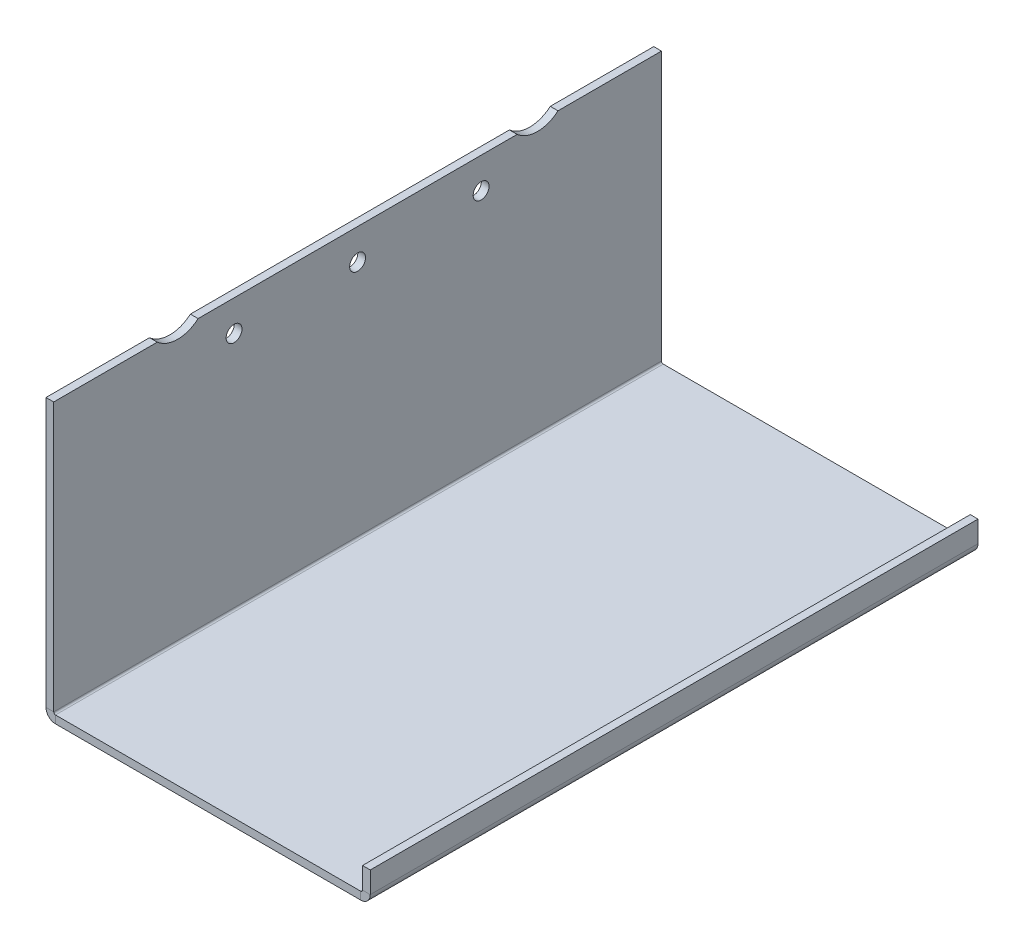
ISO-10303-21;
HEADER;
FILE_DESCRIPTION(('STEP AP214'),'2;1');
FILE_NAME('part.step','',(''),(''),'','','');
FILE_SCHEMA(('AUTOMOTIVE_DESIGN { 1 0 10303 214 1 1 1 1 }'));
ENDSEC;
DATA;
#1=APPLICATION_CONTEXT('core data for automotive mechanical design processes');
#2=APPLICATION_PROTOCOL_DEFINITION('international standard','automotive_design',2000,#1);
#3=PRODUCT_CONTEXT('',#1,'mechanical');
#4=PRODUCT('Part','Part','',(#3));
#5=PRODUCT_RELATED_PRODUCT_CATEGORY('part','',(#4));
#6=PRODUCT_DEFINITION_FORMATION('','',#4);
#7=PRODUCT_DEFINITION_CONTEXT('part definition',#1,'design');
#8=PRODUCT_DEFINITION('design','',#6,#7);
#9=PRODUCT_DEFINITION_SHAPE('','',#8);
#10=(LENGTH_UNIT() NAMED_UNIT(*) SI_UNIT(.MILLI.,.METRE.));
#11=(NAMED_UNIT(*) PLANE_ANGLE_UNIT() SI_UNIT($,.RADIAN.));
#12=(NAMED_UNIT(*) SI_UNIT($,.STERADIAN.) SOLID_ANGLE_UNIT());
#13=UNCERTAINTY_MEASURE_WITH_UNIT(LENGTH_MEASURE(1.E-05),#10,'distance_accuracy_value','');
#14=(GEOMETRIC_REPRESENTATION_CONTEXT(3) GLOBAL_UNCERTAINTY_ASSIGNED_CONTEXT((#13)) GLOBAL_UNIT_ASSIGNED_CONTEXT((#10,
#11,#12)) REPRESENTATION_CONTEXT('',''));
#15=CARTESIAN_POINT('',(0.,0.,0.));
#16=DIRECTION('',(0.,0.,1.));
#17=DIRECTION('',(1.,0.,0.));
#18=AXIS2_PLACEMENT_3D('',#15,#16,#17);
#19=CARTESIAN_POINT('',(-66.6750000000004,112.7125,-124.968));
#20=DIRECTION('',(0.,-1.,0.));
#21=DIRECTION('',(1.,0.,0.));
#22=AXIS2_PLACEMENT_3D('',#19,#20,#21);
#23=PLANE('',#22);
#24=DIRECTION('',(0.,0.,-1.));
#25=VECTOR('',#24,1.);
#26=CARTESIAN_POINT('',(-66.6750000000004,112.7125,0.));
#27=LINE('',#26,#25);
#28=CARTESIAN_POINT('',(-66.6750000000011,112.7125,65.5997395873699));
#29=VERTEX_POINT('',#28);
#30=CARTESIAN_POINT('',(-66.6750000000004,112.7125,-65.5997395873699));
#31=VERTEX_POINT('',#30);
#32=EDGE_CURVE('E290',#29,#31,#27,.T.);
#33=ORIENTED_EDGE('',*,*,#32,.F.);
#34=DIRECTION('',(1.,0.,0.));
#35=VECTOR('',#34,1.);
#36=CARTESIAN_POINT('',(-66.6750000000011,112.7125,65.5997395873699));
#37=LINE('',#36,#35);
#38=CARTESIAN_POINT('',(-63.5000000000004,112.7125,65.5997395873699));
#39=VERTEX_POINT('',#38);
#40=EDGE_CURVE('E15',#29,#39,#37,.T.);
#41=ORIENTED_EDGE('',*,*,#40,.T.);
#42=DIRECTION('',(0.,0.,1.));
#43=VECTOR('',#42,1.);
#44=CARTESIAN_POINT('',(-63.5000000000004,112.7125,-124.968));
#45=LINE('',#44,#43);
#46=CARTESIAN_POINT('',(-63.5000000000004,112.7125,-65.5997395873699));
#47=VERTEX_POINT('',#46);
#48=EDGE_CURVE('E218',#39,#47,#45,.F.);
#49=ORIENTED_EDGE('',*,*,#48,.T.);
#50=DIRECTION('',(1.,0.,0.));
#51=VECTOR('',#50,1.);
#52=CARTESIAN_POINT('',(-66.6750000000011,112.7125,-65.5997395873699));
#53=LINE('',#52,#51);
#54=EDGE_CURVE('E200',#47,#31,#53,.F.);
#55=ORIENTED_EDGE('',*,*,#54,.T.);
#56=EDGE_LOOP('',(#33,#41,#49,#55));
#57=FACE_BOUND('',#56,.T.);
#58=ADVANCED_FACE('F90',(#57),#23,.F.);
#59=CARTESIAN_POINT('',(-66.6750000000011,112.7125,-82.4002604126301));
#60=VERTEX_POINT('',#59);
#61=CARTESIAN_POINT('',(-66.6750000000004,112.7125,-124.968));
#62=VERTEX_POINT('',#61);
#63=EDGE_CURVE('E292',#60,#62,#27,.T.);
#64=ORIENTED_EDGE('',*,*,#63,.F.);
#65=DIRECTION('',(1.,0.,0.));
#66=VECTOR('',#65,1.);
#67=CARTESIAN_POINT('',(-66.6750000000011,112.7125,-82.4002604126301));
#68=LINE('',#67,#66);
#69=CARTESIAN_POINT('',(-63.5000000000004,112.7125,-82.4002604126301));
#70=VERTEX_POINT('',#69);
#71=EDGE_CURVE('E209',#60,#70,#68,.T.);
#72=ORIENTED_EDGE('',*,*,#71,.T.);
#73=CARTESIAN_POINT('',(-63.5000000000004,112.7125,-124.968));
#74=VERTEX_POINT('',#73);
#75=EDGE_CURVE('E220',#70,#74,#45,.F.);
#76=ORIENTED_EDGE('',*,*,#75,.T.);
#77=DIRECTION('',(1.,0.,0.));
#78=VECTOR('',#77,1.);
#79=CARTESIAN_POINT('',(-66.6750000000004,112.7125,-124.968));
#80=LINE('',#79,#78);
#81=EDGE_CURVE('E294',#62,#74,#80,.T.);
#82=ORIENTED_EDGE('',*,*,#81,.F.);
#83=EDGE_LOOP('',(#64,#72,#76,#82));
#84=FACE_BOUND('',#83,.T.);
#85=ADVANCED_FACE('F400',(#84),#23,.F.);
#86=CARTESIAN_POINT('',(-66.675,1.5875,-124.968));
#87=DIRECTION('',(0.,0.,1.));
#88=DIRECTION('',(1.,0.,0.));
#89=AXIS2_PLACEMENT_3D('',#86,#87,#88);
#90=PLANE('',#89);
#91=DIRECTION('',(0.,-1.,0.));
#92=VECTOR('',#91,1.);
#93=CARTESIAN_POINT('',(62.7634,1.58750000000001,-124.968));
#94=LINE('',#93,#92);
#95=CARTESIAN_POINT('',(62.7634,1.58750000000001,-124.968));
#96=VERTEX_POINT('',#95);
#97=CARTESIAN_POINT('',(62.7634,-1.58749999999999,-124.968));
#98=VERTEX_POINT('',#97);
#99=EDGE_CURVE('E318',#96,#98,#94,.T.);
#100=ORIENTED_EDGE('',*,*,#99,.T.);
#101=DIRECTION('',(-1.,0.,0.));
#102=VECTOR('',#101,1.);
#103=CARTESIAN_POINT('',(-66.675,-1.5875,-124.968));
#104=LINE('',#103,#102);
#105=CARTESIAN_POINT('',(-62.7634,-1.5875,-124.968));
#106=VERTEX_POINT('',#105);
#107=EDGE_CURVE('E265',#98,#106,#104,.T.);
#108=ORIENTED_EDGE('',*,*,#107,.T.);
#109=DIRECTION('',(0.,-1.,0.));
#110=VECTOR('',#109,1.);
#111=CARTESIAN_POINT('',(-62.7634,1.5875,-124.968));
#112=LINE('',#111,#110);
#113=CARTESIAN_POINT('',(-62.7634,1.5875,-124.968));
#114=VERTEX_POINT('',#113);
#115=EDGE_CURVE('E262',#114,#106,#112,.T.);
#116=ORIENTED_EDGE('',*,*,#115,.F.);
#117=DIRECTION('',(-1.,0.,0.));
#118=VECTOR('',#117,1.);
#119=CARTESIAN_POINT('',(-66.675,1.5875,-124.968));
#120=LINE('',#119,#118);
#121=EDGE_CURVE('E268',#96,#114,#120,.T.);
#122=ORIENTED_EDGE('',*,*,#121,.F.);
#123=EDGE_LOOP('',(#100,#108,#116,#122));
#124=FACE_BOUND('',#123,.T.);
#125=ADVANCED_FACE('F92',(#124),#90,.F.);
#126=CARTESIAN_POINT('',(-66.675,1.5875,124.968));
#127=DIRECTION('',(0.,0.,-1.));
#128=DIRECTION('',(-1.,0.,0.));
#129=AXIS2_PLACEMENT_3D('',#126,#127,#128);
#130=PLANE('',#129);
#131=DIRECTION('',(0.,-1.,0.));
#132=VECTOR('',#131,1.);
#133=CARTESIAN_POINT('',(62.7634,1.58750000000001,124.968));
#134=LINE('',#133,#132);
#135=CARTESIAN_POINT('',(62.7634,1.58750000000001,124.968));
#136=VERTEX_POINT('',#135);
#137=CARTESIAN_POINT('',(62.7634,-1.5875,124.968));
#138=VERTEX_POINT('',#137);
#139=EDGE_CURVE('E241',#136,#138,#134,.T.);
#140=ORIENTED_EDGE('',*,*,#139,.F.);
#141=DIRECTION('',(1.,0.,0.));
#142=VECTOR('',#141,1.);
#143=CARTESIAN_POINT('',(-66.675,1.5875,124.968));
#144=LINE('',#143,#142);
#145=CARTESIAN_POINT('',(-62.7634,1.5875,124.968));
#146=VERTEX_POINT('',#145);
#147=EDGE_CURVE('E210',#146,#136,#144,.T.);
#148=ORIENTED_EDGE('',*,*,#147,.F.);
#149=DIRECTION('',(0.,-1.,0.));
#150=VECTOR('',#149,1.);
#151=CARTESIAN_POINT('',(-62.7634,1.5875,124.968));
#152=LINE('',#151,#150);
#153=CARTESIAN_POINT('',(-62.7634,-1.5875,124.968));
#154=VERTEX_POINT('',#153);
#155=EDGE_CURVE('E249',#146,#154,#152,.T.);
#156=ORIENTED_EDGE('',*,*,#155,.T.);
#157=DIRECTION('',(1.,0.,0.));
#158=VECTOR('',#157,1.);
#159=CARTESIAN_POINT('',(-66.675,-1.5875,124.968));
#160=LINE('',#159,#158);
#161=EDGE_CURVE('E270',#154,#138,#160,.T.);
#162=ORIENTED_EDGE('',*,*,#161,.T.);
#163=EDGE_LOOP('',(#140,#148,#156,#162));
#164=FACE_BOUND('',#163,.T.);
#165=ADVANCED_FACE('F450',(#164),#130,.F.);
#166=CARTESIAN_POINT('',(0.,1.5875,0.));
#167=DIRECTION('',(0.,-1.,0.));
#168=DIRECTION('',(0.,0.,-1.));
#169=AXIS2_PLACEMENT_3D('',#166,#167,#168);
#170=PLANE('',#169);
#171=DIRECTION('',(0.,0.,-1.));
#172=VECTOR('',#171,1.);
#173=CARTESIAN_POINT('',(62.7634,1.58750000000001,-124.968));
#174=LINE('',#173,#172);
#175=EDGE_CURVE('E327',#96,#136,#174,.F.);
#176=ORIENTED_EDGE('',*,*,#175,.F.);
#177=ORIENTED_EDGE('',*,*,#121,.T.);
#178=DIRECTION('',(0.,0.,1.));
#179=VECTOR('',#178,1.);
#180=CARTESIAN_POINT('',(-62.7634,1.5875,124.968));
#181=LINE('',#180,#179);
#182=EDGE_CURVE('E255',#146,#114,#181,.F.);
#183=ORIENTED_EDGE('',*,*,#182,.F.);
#184=ORIENTED_EDGE('',*,*,#147,.T.);
#185=EDGE_LOOP('',(#176,#177,#183,#184));
#186=FACE_BOUND('',#185,.T.);
#187=ADVANCED_FACE('F447',(#186),#170,.F.);
#188=CARTESIAN_POINT('',(0.,-1.5875,0.));
#189=DIRECTION('',(0.,-1.,0.));
#190=DIRECTION('',(0.,0.,-1.));
#191=AXIS2_PLACEMENT_3D('',#188,#189,#190);
#192=PLANE('',#191);
#193=ORIENTED_EDGE('',*,*,#107,.F.);
#194=DIRECTION('',(0.,0.,-1.));
#195=VECTOR('',#194,1.);
#196=CARTESIAN_POINT('',(62.7634,-1.58749999999999,-124.968));
#197=LINE('',#196,#195);
#198=EDGE_CURVE('E336',#98,#138,#197,.F.);
#199=ORIENTED_EDGE('',*,*,#198,.T.);
#200=ORIENTED_EDGE('',*,*,#161,.F.);
#201=DIRECTION('',(0.,0.,1.));
#202=VECTOR('',#201,1.);
#203=CARTESIAN_POINT('',(-62.7634,-1.5875,124.968));
#204=LINE('',#203,#202);
#205=EDGE_CURVE('E242',#154,#106,#204,.F.);
#206=ORIENTED_EDGE('',*,*,#205,.T.);
#207=EDGE_LOOP('',(#193,#199,#200,#206));
#208=FACE_BOUND('',#207,.T.);
#209=ADVANCED_FACE('F443',(#208),#192,.T.);
#210=CARTESIAN_POINT('',(-62.7634,2.3241,-124.968));
#211=DIRECTION('',(0.,0.,-1.));
#212=DIRECTION('',(-1.,0.,0.));
#213=AXIS2_PLACEMENT_3D('',#210,#211,#212);
#214=PLANE('',#213);
#215=DIRECTION('',(1.,0.,0.));
#216=VECTOR('',#215,1.);
#217=CARTESIAN_POINT('',(-66.675,2.3241,-124.968));
#218=LINE('',#217,#216);
#219=CARTESIAN_POINT('',(-63.5,2.3241,-124.968));
#220=VERTEX_POINT('',#219);
#221=CARTESIAN_POINT('',(-66.675,2.32409999999999,-124.968));
#222=VERTEX_POINT('',#221);
#223=EDGE_CURVE('E238',#220,#222,#218,.F.);
#224=ORIENTED_EDGE('',*,*,#223,.F.);
#225=CARTESIAN_POINT('',(-62.7634,2.3241,-124.968));
#226=DIRECTION('',(0.,0.,1.));
#227=DIRECTION('',(1.,0.,0.));
#228=AXIS2_PLACEMENT_3D('',#225,#226,#227);
#229=CIRCLE('',#228,0.736600000000004);
#230=EDGE_CURVE('E252',#114,#220,#229,.F.);
#231=ORIENTED_EDGE('',*,*,#230,.F.);
#232=ORIENTED_EDGE('',*,*,#115,.T.);
#233=CARTESIAN_POINT('',(-62.7634,2.3241,-124.968));
#234=DIRECTION('',(0.,0.,1.));
#235=DIRECTION('',(1.,0.,0.));
#236=AXIS2_PLACEMENT_3D('',#233,#234,#235);
#237=CIRCLE('',#236,3.9116);
#238=EDGE_CURVE('E245',#106,#222,#237,.F.);
#239=ORIENTED_EDGE('',*,*,#238,.T.);
#240=EDGE_LOOP('',(#224,#231,#232,#239));
#241=FACE_BOUND('',#240,.T.);
#242=ADVANCED_FACE('F440',(#241),#214,.T.);
#243=CARTESIAN_POINT('',(-62.7634,2.3241,124.968));
#244=DIRECTION('',(0.,0.,-1.));
#245=DIRECTION('',(-1.,0.,0.));
#246=AXIS2_PLACEMENT_3D('',#243,#244,#245);
#247=PLANE('',#246);
#248=CARTESIAN_POINT('',(-62.7634,2.3241,124.968));
#249=DIRECTION('',(0.,0.,1.));
#250=DIRECTION('',(1.,0.,0.));
#251=AXIS2_PLACEMENT_3D('',#248,#249,#250);
#252=CIRCLE('',#251,0.736600000000004);
#253=CARTESIAN_POINT('',(-63.5,2.3241,124.968));
#254=VERTEX_POINT('',#253);
#255=EDGE_CURVE('E258',#254,#146,#252,.T.);
#256=ORIENTED_EDGE('',*,*,#255,.F.);
#257=DIRECTION('',(1.,0.,0.));
#258=VECTOR('',#257,1.);
#259=CARTESIAN_POINT('',(-63.5,2.3241,124.968));
#260=LINE('',#259,#258);
#261=CARTESIAN_POINT('',(-66.675,2.32409999999998,124.968));
#262=VERTEX_POINT('',#261);
#263=EDGE_CURVE('E233',#254,#262,#260,.F.);
#264=ORIENTED_EDGE('',*,*,#263,.T.);
#265=CARTESIAN_POINT('',(-62.7634,2.3241,124.968));
#266=DIRECTION('',(0.,0.,1.));
#267=DIRECTION('',(1.,0.,0.));
#268=AXIS2_PLACEMENT_3D('',#265,#266,#267);
#269=CIRCLE('',#268,3.9116);
#270=EDGE_CURVE('E246',#262,#154,#269,.T.);
#271=ORIENTED_EDGE('',*,*,#270,.T.);
#272=ORIENTED_EDGE('',*,*,#155,.F.);
#273=EDGE_LOOP('',(#256,#264,#271,#272));
#274=FACE_BOUND('',#273,.T.);
#275=ADVANCED_FACE('F312',(#274),#247,.F.);
#276=CARTESIAN_POINT('',(-62.7634,2.3241,124.968));
#277=DIRECTION('',(0.,0.,1.));
#278=DIRECTION('',(-1.,0.,0.));
#279=AXIS2_PLACEMENT_3D('',#276,#277,#278);
#280=CYLINDRICAL_SURFACE('',#279,3.9116);
#281=ORIENTED_EDGE('',*,*,#205,.F.);
#282=ORIENTED_EDGE('',*,*,#270,.F.);
#283=DIRECTION('',(0.,0.,1.));
#284=VECTOR('',#283,1.);
#285=CARTESIAN_POINT('',(-66.675,2.3241,-124.968));
#286=LINE('',#285,#284);
#287=EDGE_CURVE('E231',#262,#222,#286,.F.);
#288=ORIENTED_EDGE('',*,*,#287,.T.);
#289=ORIENTED_EDGE('',*,*,#238,.F.);
#290=EDGE_LOOP('',(#281,#282,#288,#289));
#291=FACE_BOUND('',#290,.T.);
#292=ADVANCED_FACE('F434',(#291),#280,.T.);
#293=CARTESIAN_POINT('',(-62.7634,2.3241,124.968));
#294=DIRECTION('',(0.,0.,1.));
#295=DIRECTION('',(-1.,0.,0.));
#296=AXIS2_PLACEMENT_3D('',#293,#294,#295);
#297=CYLINDRICAL_SURFACE('',#296,0.736600000000004);
#298=ORIENTED_EDGE('',*,*,#182,.T.);
#299=ORIENTED_EDGE('',*,*,#230,.T.);
#300=DIRECTION('',(0.,0.,1.));
#301=VECTOR('',#300,1.);
#302=CARTESIAN_POINT('',(-63.5,2.32410000000001,-124.968));
#303=LINE('',#302,#301);
#304=EDGE_CURVE('E236',#220,#254,#303,.T.);
#305=ORIENTED_EDGE('',*,*,#304,.T.);
#306=ORIENTED_EDGE('',*,*,#255,.T.);
#307=EDGE_LOOP('',(#298,#299,#305,#306));
#308=FACE_BOUND('',#307,.T.);
#309=ADVANCED_FACE('F307',(#308),#297,.F.);
#310=CARTESIAN_POINT('',(-66.6750000000004,112.7125,124.968));
#311=DIRECTION('',(0.,0.,-1.));
#312=DIRECTION('',(-1.,0.,0.));
#313=AXIS2_PLACEMENT_3D('',#310,#311,#312);
#314=PLANE('',#313);
#315=ORIENTED_EDGE('',*,*,#263,.F.);
#316=DIRECTION('',(0.,-1.,0.));
#317=VECTOR('',#316,1.);
#318=CARTESIAN_POINT('',(-63.5000000000004,112.7125,124.968));
#319=LINE('',#318,#317);
#320=CARTESIAN_POINT('',(-63.5000000000004,112.7125,124.968));
#321=VERTEX_POINT('',#320);
#322=EDGE_CURVE('E226',#254,#321,#319,.F.);
#323=ORIENTED_EDGE('',*,*,#322,.T.);
#324=DIRECTION('',(1.,0.,0.));
#325=VECTOR('',#324,1.);
#326=CARTESIAN_POINT('',(-66.6750000000004,112.7125,124.968));
#327=LINE('',#326,#325);
#328=CARTESIAN_POINT('',(-66.6750000000004,112.7125,124.968));
#329=VERTEX_POINT('',#328);
#330=EDGE_CURVE('E261',#329,#321,#327,.T.);
#331=ORIENTED_EDGE('',*,*,#330,.F.);
#332=DIRECTION('',(0.,1.,0.));
#333=VECTOR('',#332,1.);
#334=CARTESIAN_POINT('',(-66.675,-2.4423228842211E-13,124.968));
#335=LINE('',#334,#333);
#336=EDGE_CURVE('E287',#262,#329,#335,.T.);
#337=ORIENTED_EDGE('',*,*,#336,.F.);
#338=EDGE_LOOP('',(#315,#323,#331,#337));
#339=FACE_BOUND('',#338,.T.);
#340=ADVANCED_FACE('F314',(#339),#314,.F.);
#341=CARTESIAN_POINT('',(-66.675,1.58749999999999,-124.968));
#342=DIRECTION('',(0.,0.,1.));
#343=DIRECTION('',(1.,0.,0.));
#344=AXIS2_PLACEMENT_3D('',#341,#342,#343);
#345=PLANE('',#344);
#346=ORIENTED_EDGE('',*,*,#223,.T.);
#347=DIRECTION('',(0.,-1.,0.));
#348=VECTOR('',#347,1.);
#349=CARTESIAN_POINT('',(-66.675,-2.4423228842211E-13,-124.968));
#350=LINE('',#349,#348);
#351=EDGE_CURVE('E289',#62,#222,#350,.T.);
#352=ORIENTED_EDGE('',*,*,#351,.F.);
#353=ORIENTED_EDGE('',*,*,#81,.T.);
#354=DIRECTION('',(0.,1.,0.));
#355=VECTOR('',#354,1.);
#356=CARTESIAN_POINT('',(-63.5,1.5875,-124.968));
#357=LINE('',#356,#355);
#358=EDGE_CURVE('E225',#74,#220,#357,.F.);
#359=ORIENTED_EDGE('',*,*,#358,.T.);
#360=EDGE_LOOP('',(#346,#352,#353,#359));
#361=FACE_BOUND('',#360,.T.);
#362=ADVANCED_FACE('F301',(#361),#345,.F.);
#363=CARTESIAN_POINT('',(-66.675,-2.4423228842211E-13,0.));
#364=DIRECTION('',(1.,0.,0.));
#365=DIRECTION('',(0.,1.,0.));
#366=AXIS2_PLACEMENT_3D('',#363,#364,#365);
#367=PLANE('',#366);
#368=CARTESIAN_POINT('',(-66.6750000000007,100.0125,50.8));
#369=DIRECTION('',(1.,0.,0.));
#370=DIRECTION('',(0.,1.,0.));
#371=AXIS2_PLACEMENT_3D('',#368,#369,#370);
#372=CIRCLE('',#371,3.26389999999998);
#373=CARTESIAN_POINT('',(-66.6750000000008,103.2764,50.8));
#374=VERTEX_POINT('',#373);
#375=EDGE_CURVE('E345',#374,#374,#372,.T.);
#376=ORIENTED_EDGE('',*,*,#375,.T.);
#377=EDGE_LOOP('',(#376));
#378=FACE_BOUND('',#377,.T.);
#379=CARTESIAN_POINT('',(-66.6750000000007,100.0125,-50.8));
#380=DIRECTION('',(1.,0.,0.));
#381=DIRECTION('',(0.,-1.,0.));
#382=AXIS2_PLACEMENT_3D('',#379,#380,#381);
#383=CIRCLE('',#382,3.26389999999998);
#384=CARTESIAN_POINT('',(-66.6750000000007,96.7486,-50.8));
#385=VERTEX_POINT('',#384);
#386=EDGE_CURVE('E380',#385,#385,#383,.T.);
#387=ORIENTED_EDGE('',*,*,#386,.T.);
#388=EDGE_LOOP('',(#387));
#389=FACE_BOUND('',#388,.T.);
#390=CARTESIAN_POINT('',(-66.6750000000007,100.0125,0.));
#391=DIRECTION('',(1.,0.,0.));
#392=DIRECTION('',(0.,1.,0.));
#393=AXIS2_PLACEMENT_3D('',#390,#391,#392);
#394=CIRCLE('',#393,3.2639);
#395=CARTESIAN_POINT('',(-66.6750000000008,103.2764,0.));
#396=VERTEX_POINT('',#395);
#397=EDGE_CURVE('E374',#396,#396,#394,.T.);
#398=ORIENTED_EDGE('',*,*,#397,.T.);
#399=EDGE_LOOP('',(#398));
#400=FACE_BOUND('',#399,.T.);
#401=CARTESIAN_POINT('',(-66.6750000000004,112.7125,82.4002604126301));
#402=VERTEX_POINT('',#401);
#403=EDGE_CURVE('E281',#329,#402,#27,.T.);
#404=ORIENTED_EDGE('',*,*,#403,.T.);
#405=CARTESIAN_POINT('',(-66.6750000000012,122.2375,74.));
#406=DIRECTION('',(1.,0.,0.));
#407=DIRECTION('',(0.,1.,0.));
#408=AXIS2_PLACEMENT_3D('',#405,#406,#407);
#409=CIRCLE('',#408,12.7);
#410=EDGE_CURVE('E113',#402,#29,#409,.T.);
#411=ORIENTED_EDGE('',*,*,#410,.T.);
#412=ORIENTED_EDGE('',*,*,#32,.T.);
#413=CARTESIAN_POINT('',(-66.6750000000012,122.2375,-74.));
#414=DIRECTION('',(1.,0.,0.));
#415=DIRECTION('',(0.,1.,0.));
#416=AXIS2_PLACEMENT_3D('',#413,#414,#415);
#417=CIRCLE('',#416,12.7);
#418=EDGE_CURVE('E105',#31,#60,#417,.T.);
#419=ORIENTED_EDGE('',*,*,#418,.T.);
#420=ORIENTED_EDGE('',*,*,#63,.T.);
#421=ORIENTED_EDGE('',*,*,#351,.T.);
#422=ORIENTED_EDGE('',*,*,#287,.F.);
#423=ORIENTED_EDGE('',*,*,#336,.T.);
#424=EDGE_LOOP('',(#404,#411,#412,#419,#420,#421,#422,#423));
#425=FACE_BOUND('',#424,.T.);
#426=ADVANCED_FACE('F284',(#378,#389,#400,#425),#367,.F.);
#427=CARTESIAN_POINT('',(-63.5,-2.33146835171283E-13,0.));
#428=DIRECTION('',(1.,0.,0.));
#429=DIRECTION('',(0.,1.,0.));
#430=AXIS2_PLACEMENT_3D('',#427,#428,#429);
#431=PLANE('',#430);
#432=CARTESIAN_POINT('',(-63.5000000000004,122.2375,74.));
#433=DIRECTION('',(1.,0.,0.));
#434=DIRECTION('',(0.,1.,0.));
#435=AXIS2_PLACEMENT_3D('',#432,#433,#434);
#436=CIRCLE('',#435,12.7);
#437=CARTESIAN_POINT('',(-63.5000000000004,112.7125,82.4002604126301));
#438=VERTEX_POINT('',#437);
#439=EDGE_CURVE('E389',#438,#39,#436,.T.);
#440=ORIENTED_EDGE('',*,*,#439,.F.);
#441=EDGE_CURVE('E222',#321,#438,#45,.F.);
#442=ORIENTED_EDGE('',*,*,#441,.F.);
#443=ORIENTED_EDGE('',*,*,#322,.F.);
#444=ORIENTED_EDGE('',*,*,#304,.F.);
#445=ORIENTED_EDGE('',*,*,#358,.F.);
#446=ORIENTED_EDGE('',*,*,#75,.F.);
#447=CARTESIAN_POINT('',(-63.5000000000004,122.2375,-74.));
#448=DIRECTION('',(1.,0.,0.));
#449=DIRECTION('',(0.,1.,0.));
#450=AXIS2_PLACEMENT_3D('',#447,#448,#449);
#451=CIRCLE('',#450,12.7);
#452=EDGE_CURVE('E203',#47,#70,#451,.T.);
#453=ORIENTED_EDGE('',*,*,#452,.F.);
#454=ORIENTED_EDGE('',*,*,#48,.F.);
#455=EDGE_LOOP('',(#440,#442,#443,#444,#445,#446,#453,#454));
#456=FACE_BOUND('',#455,.T.);
#457=CARTESIAN_POINT('',(-63.5000000000003,100.0125,50.8));
#458=DIRECTION('',(1.,0.,0.));
#459=DIRECTION('',(0.,1.,0.));
#460=AXIS2_PLACEMENT_3D('',#457,#458,#459);
#461=CIRCLE('',#460,3.26389999999998);
#462=CARTESIAN_POINT('',(-63.5000000000004,103.2764,50.8));
#463=VERTEX_POINT('',#462);
#464=EDGE_CURVE('E383',#463,#463,#461,.T.);
#465=ORIENTED_EDGE('',*,*,#464,.F.);
#466=EDGE_LOOP('',(#465));
#467=FACE_BOUND('',#466,.T.);
#468=CARTESIAN_POINT('',(-63.5000000000003,100.0125,-50.8));
#469=DIRECTION('',(1.,0.,0.));
#470=DIRECTION('',(0.,-1.,0.));
#471=AXIS2_PLACEMENT_3D('',#468,#469,#470);
#472=CIRCLE('',#471,3.26389999999998);
#473=CARTESIAN_POINT('',(-63.5000000000003,96.7486,-50.8));
#474=VERTEX_POINT('',#473);
#475=EDGE_CURVE('E377',#474,#474,#472,.T.);
#476=ORIENTED_EDGE('',*,*,#475,.F.);
#477=EDGE_LOOP('',(#476));
#478=FACE_BOUND('',#477,.T.);
#479=CARTESIAN_POINT('',(-63.5000000000003,100.0125,0.));
#480=DIRECTION('',(1.,0.,0.));
#481=DIRECTION('',(0.,1.,0.));
#482=AXIS2_PLACEMENT_3D('',#479,#480,#481);
#483=CIRCLE('',#482,3.2639);
#484=CARTESIAN_POINT('',(-63.5000000000004,103.2764,0.));
#485=VERTEX_POINT('',#484);
#486=EDGE_CURVE('E371',#485,#485,#483,.T.);
#487=ORIENTED_EDGE('',*,*,#486,.F.);
#488=EDGE_LOOP('',(#487));
#489=FACE_BOUND('',#488,.T.);
#490=ADVANCED_FACE('F216',(#456,#467,#478,#489),#431,.T.);
#491=ORIENTED_EDGE('',*,*,#441,.T.);
#492=DIRECTION('',(1.,0.,0.));
#493=VECTOR('',#492,1.);
#494=CARTESIAN_POINT('',(-66.6750000000011,112.7125,82.4002604126301));
#495=LINE('',#494,#493);
#496=EDGE_CURVE('E98',#438,#402,#495,.F.);
#497=ORIENTED_EDGE('',*,*,#496,.T.);
#498=ORIENTED_EDGE('',*,*,#403,.F.);
#499=ORIENTED_EDGE('',*,*,#330,.T.);
#500=EDGE_LOOP('',(#491,#497,#498,#499));
#501=FACE_BOUND('',#500,.T.);
#502=ADVANCED_FACE('F279',(#501),#23,.F.);
#503=CARTESIAN_POINT('',(62.7634,2.32410000000002,124.968));
#504=DIRECTION('',(0.,0.,1.));
#505=DIRECTION('',(1.,0.,0.));
#506=AXIS2_PLACEMENT_3D('',#503,#504,#505);
#507=PLANE('',#506);
#508=DIRECTION('',(-1.,0.,0.));
#509=VECTOR('',#508,1.);
#510=CARTESIAN_POINT('',(66.675,2.3241,124.968));
#511=LINE('',#510,#509);
#512=CARTESIAN_POINT('',(63.5,2.32410000000002,124.968));
#513=VERTEX_POINT('',#512);
#514=CARTESIAN_POINT('',(66.675,2.32410000000001,124.968));
#515=VERTEX_POINT('',#514);
#516=EDGE_CURVE('E341',#513,#515,#511,.F.);
#517=ORIENTED_EDGE('',*,*,#516,.F.);
#518=CARTESIAN_POINT('',(62.7634,2.32410000000002,124.968));
#519=DIRECTION('',(0.,0.,-1.));
#520=DIRECTION('',(-1.,0.,0.));
#521=AXIS2_PLACEMENT_3D('',#518,#519,#520);
#522=CIRCLE('',#521,0.736600000000004);
#523=EDGE_CURVE('E330',#136,#513,#522,.F.);
#524=ORIENTED_EDGE('',*,*,#523,.F.);
#525=ORIENTED_EDGE('',*,*,#139,.T.);
#526=CARTESIAN_POINT('',(62.7634,2.32410000000002,124.968));
#527=DIRECTION('',(0.,0.,-1.));
#528=DIRECTION('',(-1.,0.,0.));
#529=AXIS2_PLACEMENT_3D('',#526,#527,#528);
#530=CIRCLE('',#529,3.9116);
#531=EDGE_CURVE('E321',#138,#515,#530,.F.);
#532=ORIENTED_EDGE('',*,*,#531,.T.);
#533=EDGE_LOOP('',(#517,#524,#525,#532));
#534=FACE_BOUND('',#533,.T.);
#535=ADVANCED_FACE('F410',(#534),#507,.T.);
#536=CARTESIAN_POINT('',(62.7634,2.32410000000002,-124.968));
#537=DIRECTION('',(0.,0.,1.));
#538=DIRECTION('',(1.,0.,0.));
#539=AXIS2_PLACEMENT_3D('',#536,#537,#538);
#540=PLANE('',#539);
#541=CARTESIAN_POINT('',(62.7634,2.32410000000002,-124.968));
#542=DIRECTION('',(0.,0.,-1.));
#543=DIRECTION('',(-1.,0.,0.));
#544=AXIS2_PLACEMENT_3D('',#541,#542,#543);
#545=CIRCLE('',#544,0.736600000000004);
#546=CARTESIAN_POINT('',(63.5,2.32410000000002,-124.968));
#547=VERTEX_POINT('',#546);
#548=EDGE_CURVE('E324',#547,#96,#545,.T.);
#549=ORIENTED_EDGE('',*,*,#548,.F.);
#550=DIRECTION('',(-1.,0.,0.));
#551=VECTOR('',#550,1.);
#552=CARTESIAN_POINT('',(63.5,2.32410000000002,-124.968));
#553=LINE('',#552,#551);
#554=CARTESIAN_POINT('',(66.675,2.32410000000001,-124.968));
#555=VERTEX_POINT('',#554);
#556=EDGE_CURVE('E347',#547,#555,#553,.F.);
#557=ORIENTED_EDGE('',*,*,#556,.T.);
#558=CARTESIAN_POINT('',(62.7634,2.32410000000002,-124.968));
#559=DIRECTION('',(0.,0.,-1.));
#560=DIRECTION('',(-1.,0.,0.));
#561=AXIS2_PLACEMENT_3D('',#558,#559,#560);
#562=CIRCLE('',#561,3.9116);
#563=EDGE_CURVE('E333',#555,#98,#562,.T.);
#564=ORIENTED_EDGE('',*,*,#563,.T.);
#565=ORIENTED_EDGE('',*,*,#99,.F.);
#566=EDGE_LOOP('',(#549,#557,#564,#565));
#567=FACE_BOUND('',#566,.T.);
#568=ADVANCED_FACE('F416',(#567),#540,.F.);
#569=CARTESIAN_POINT('',(62.7634,2.32410000000002,-124.968));
#570=DIRECTION('',(0.,0.,-1.));
#571=DIRECTION('',(1.,0.,0.));
#572=AXIS2_PLACEMENT_3D('',#569,#570,#571);
#573=CYLINDRICAL_SURFACE('',#572,3.9116);
#574=ORIENTED_EDGE('',*,*,#198,.F.);
#575=ORIENTED_EDGE('',*,*,#563,.F.);
#576=DIRECTION('',(0.,0.,-1.));
#577=VECTOR('',#576,1.);
#578=CARTESIAN_POINT('',(66.675,2.3241,124.968));
#579=LINE('',#578,#577);
#580=EDGE_CURVE('E350',#555,#515,#579,.F.);
#581=ORIENTED_EDGE('',*,*,#580,.T.);
#582=ORIENTED_EDGE('',*,*,#531,.F.);
#583=EDGE_LOOP('',(#574,#575,#581,#582));
#584=FACE_BOUND('',#583,.T.);
#585=ADVANCED_FACE('F470',(#584),#573,.T.);
#586=CARTESIAN_POINT('',(62.7634,2.32410000000002,-124.968));
#587=DIRECTION('',(0.,0.,-1.));
#588=DIRECTION('',(1.,0.,0.));
#589=AXIS2_PLACEMENT_3D('',#586,#587,#588);
#590=CYLINDRICAL_SURFACE('',#589,0.736600000000004);
#591=ORIENTED_EDGE('',*,*,#175,.T.);
#592=ORIENTED_EDGE('',*,*,#523,.T.);
#593=DIRECTION('',(0.,0.,-1.));
#594=VECTOR('',#593,1.);
#595=CARTESIAN_POINT('',(63.5,2.32410000000001,124.968));
#596=LINE('',#595,#594);
#597=EDGE_CURVE('E344',#513,#547,#596,.T.);
#598=ORIENTED_EDGE('',*,*,#597,.T.);
#599=ORIENTED_EDGE('',*,*,#548,.T.);
#600=EDGE_LOOP('',(#591,#592,#598,#599));
#601=FACE_BOUND('',#600,.T.);
#602=ADVANCED_FACE('F493',(#601),#590,.F.);
#603=CARTESIAN_POINT('',(66.675,11.1125,-124.968));
#604=DIRECTION('',(0.,0.,1.));
#605=DIRECTION('',(1.,0.,0.));
#606=AXIS2_PLACEMENT_3D('',#603,#604,#605);
#607=PLANE('',#606);
#608=ORIENTED_EDGE('',*,*,#556,.F.);
#609=DIRECTION('',(0.,-1.,0.));
#610=VECTOR('',#609,1.);
#611=CARTESIAN_POINT('',(63.5,11.1125,-124.968));
#612=LINE('',#611,#610);
#613=CARTESIAN_POINT('',(63.5,11.1125,-124.968));
#614=VERTEX_POINT('',#613);
#615=EDGE_CURVE('E352',#547,#614,#612,.F.);
#616=ORIENTED_EDGE('',*,*,#615,.T.);
#617=DIRECTION('',(-1.,0.,0.));
#618=VECTOR('',#617,1.);
#619=CARTESIAN_POINT('',(66.675,11.1125,-124.968));
#620=LINE('',#619,#618);
#621=CARTESIAN_POINT('',(66.675,11.1125,-124.968));
#622=VERTEX_POINT('',#621);
#623=EDGE_CURVE('E328',#622,#614,#620,.T.);
#624=ORIENTED_EDGE('',*,*,#623,.F.);
#625=DIRECTION('',(0.,1.,0.));
#626=VECTOR('',#625,1.);
#627=CARTESIAN_POINT('',(66.675,-2.05374482560229E-13,-124.968));
#628=LINE('',#627,#626);
#629=EDGE_CURVE('E359',#555,#622,#628,.T.);
#630=ORIENTED_EDGE('',*,*,#629,.F.);
#631=EDGE_LOOP('',(#608,#616,#624,#630));
#632=FACE_BOUND('',#631,.T.);
#633=ADVANCED_FACE('F482',(#632),#607,.F.);
#634=CARTESIAN_POINT('',(66.675,1.58749999999999,124.968));
#635=DIRECTION('',(0.,0.,-1.));
#636=DIRECTION('',(-1.,0.,0.));
#637=AXIS2_PLACEMENT_3D('',#634,#635,#636);
#638=PLANE('',#637);
#639=ORIENTED_EDGE('',*,*,#516,.T.);
#640=DIRECTION('',(0.,-1.,0.));
#641=VECTOR('',#640,1.);
#642=CARTESIAN_POINT('',(66.675,-2.05374482560229E-13,124.968));
#643=LINE('',#642,#641);
#644=CARTESIAN_POINT('',(66.675,11.1125,124.968));
#645=VERTEX_POINT('',#644);
#646=EDGE_CURVE('E363',#645,#515,#643,.T.);
#647=ORIENTED_EDGE('',*,*,#646,.F.);
#648=DIRECTION('',(-1.,0.,0.));
#649=VECTOR('',#648,1.);
#650=CARTESIAN_POINT('',(66.675,11.1125,124.968));
#651=LINE('',#650,#649);
#652=CARTESIAN_POINT('',(63.5,11.1125,124.968));
#653=VERTEX_POINT('',#652);
#654=EDGE_CURVE('E366',#645,#653,#651,.T.);
#655=ORIENTED_EDGE('',*,*,#654,.T.);
#656=DIRECTION('',(0.,1.,0.));
#657=VECTOR('',#656,1.);
#658=CARTESIAN_POINT('',(63.5,1.5875,124.968));
#659=LINE('',#658,#657);
#660=EDGE_CURVE('E356',#653,#513,#659,.F.);
#661=ORIENTED_EDGE('',*,*,#660,.T.);
#662=EDGE_LOOP('',(#639,#647,#655,#661));
#663=FACE_BOUND('',#662,.T.);
#664=ADVANCED_FACE('F490',(#663),#638,.F.);
#665=CARTESIAN_POINT('',(66.675,-2.05374482560229E-13,0.));
#666=DIRECTION('',(-1.,0.,0.));
#667=DIRECTION('',(0.,-1.,0.));
#668=AXIS2_PLACEMENT_3D('',#665,#666,#667);
#669=PLANE('',#668);
#670=ORIENTED_EDGE('',*,*,#580,.F.);
#671=ORIENTED_EDGE('',*,*,#629,.T.);
#672=DIRECTION('',(0.,0.,1.));
#673=VECTOR('',#672,1.);
#674=CARTESIAN_POINT('',(66.675,11.1125,0.));
#675=LINE('',#674,#673);
#676=EDGE_CURVE('E361',#622,#645,#675,.T.);
#677=ORIENTED_EDGE('',*,*,#676,.T.);
#678=ORIENTED_EDGE('',*,*,#646,.T.);
#679=EDGE_LOOP('',(#670,#671,#677,#678));
#680=FACE_BOUND('',#679,.T.);
#681=ADVANCED_FACE('F479',(#680),#669,.F.);
#682=CARTESIAN_POINT('',(63.5,-1.94289029309402E-13,0.));
#683=DIRECTION('',(-1.,0.,0.));
#684=DIRECTION('',(0.,-1.,0.));
#685=AXIS2_PLACEMENT_3D('',#682,#683,#684);
#686=PLANE('',#685);
#687=ORIENTED_EDGE('',*,*,#615,.F.);
#688=ORIENTED_EDGE('',*,*,#597,.F.);
#689=ORIENTED_EDGE('',*,*,#660,.F.);
#690=DIRECTION('',(0.,0.,-1.));
#691=VECTOR('',#690,1.);
#692=CARTESIAN_POINT('',(63.5,11.1125,124.968));
#693=LINE('',#692,#691);
#694=EDGE_CURVE('E354',#614,#653,#693,.F.);
#695=ORIENTED_EDGE('',*,*,#694,.F.);
#696=EDGE_LOOP('',(#687,#688,#689,#695));
#697=FACE_BOUND('',#696,.T.);
#698=ADVANCED_FACE('F495',(#697),#686,.T.);
#699=CARTESIAN_POINT('',(66.675,11.1125,124.968));
#700=DIRECTION('',(0.,-1.,0.));
#701=DIRECTION('',(1.,0.,0.));
#702=AXIS2_PLACEMENT_3D('',#699,#700,#701);
#703=PLANE('',#702);
#704=ORIENTED_EDGE('',*,*,#694,.T.);
#705=ORIENTED_EDGE('',*,*,#654,.F.);
#706=ORIENTED_EDGE('',*,*,#676,.F.);
#707=ORIENTED_EDGE('',*,*,#623,.T.);
#708=EDGE_LOOP('',(#704,#705,#706,#707));
#709=FACE_BOUND('',#708,.T.);
#710=ADVANCED_FACE('F487',(#709),#703,.F.);
#711=CARTESIAN_POINT('',(-66.6750000000007,100.0125,0.));
#712=DIRECTION('',(1.,0.,0.));
#713=DIRECTION('',(0.,1.,0.));
#714=AXIS2_PLACEMENT_3D('',#711,#712,#713);
#715=CYLINDRICAL_SURFACE('',#714,3.2639);
#716=ORIENTED_EDGE('',*,*,#397,.F.);
#717=EDGE_LOOP('',(#716));
#718=FACE_BOUND('',#717,.T.);
#719=ORIENTED_EDGE('',*,*,#486,.T.);
#720=EDGE_LOOP('',(#719));
#721=FACE_BOUND('',#720,.T.);
#722=ADVANCED_FACE('F502',(#718,#721),#715,.F.);
#723=CARTESIAN_POINT('',(-66.6750000000007,100.0125,-50.8));
#724=DIRECTION('',(1.,0.,0.));
#725=DIRECTION('',(0.,1.,0.));
#726=AXIS2_PLACEMENT_3D('',#723,#724,#725);
#727=CYLINDRICAL_SURFACE('',#726,3.26389999999998);
#728=ORIENTED_EDGE('',*,*,#386,.F.);
#729=EDGE_LOOP('',(#728));
#730=FACE_BOUND('',#729,.T.);
#731=ORIENTED_EDGE('',*,*,#475,.T.);
#732=EDGE_LOOP('',(#731));
#733=FACE_BOUND('',#732,.T.);
#734=ADVANCED_FACE('F561',(#730,#733),#727,.F.);
#735=CARTESIAN_POINT('',(-66.6750000000007,100.0125,50.8));
#736=DIRECTION('',(1.,0.,0.));
#737=DIRECTION('',(0.,1.,0.));
#738=AXIS2_PLACEMENT_3D('',#735,#736,#737);
#739=CYLINDRICAL_SURFACE('',#738,3.26389999999998);
#740=ORIENTED_EDGE('',*,*,#375,.F.);
#741=EDGE_LOOP('',(#740));
#742=FACE_BOUND('',#741,.T.);
#743=ORIENTED_EDGE('',*,*,#464,.T.);
#744=EDGE_LOOP('',(#743));
#745=FACE_BOUND('',#744,.T.);
#746=ADVANCED_FACE('F397',(#742,#745),#739,.F.);
#747=CARTESIAN_POINT('',(-66.6750000000012,122.2375,-74.));
#748=DIRECTION('',(1.,0.,0.));
#749=DIRECTION('',(0.,1.,0.));
#750=AXIS2_PLACEMENT_3D('',#747,#748,#749);
#751=CYLINDRICAL_SURFACE('',#750,12.7);
#752=ORIENTED_EDGE('',*,*,#418,.F.);
#753=ORIENTED_EDGE('',*,*,#54,.F.);
#754=ORIENTED_EDGE('',*,*,#452,.T.);
#755=ORIENTED_EDGE('',*,*,#71,.F.);
#756=EDGE_LOOP('',(#752,#753,#754,#755));
#757=FACE_BOUND('',#756,.T.);
#758=ADVANCED_FACE('F202',(#757),#751,.F.);
#759=CARTESIAN_POINT('',(-66.6750000000012,122.2375,74.));
#760=DIRECTION('',(1.,0.,0.));
#761=DIRECTION('',(0.,1.,0.));
#762=AXIS2_PLACEMENT_3D('',#759,#760,#761);
#763=CYLINDRICAL_SURFACE('',#762,12.7);
#764=ORIENTED_EDGE('',*,*,#410,.F.);
#765=ORIENTED_EDGE('',*,*,#496,.F.);
#766=ORIENTED_EDGE('',*,*,#439,.T.);
#767=ORIENTED_EDGE('',*,*,#40,.F.);
#768=EDGE_LOOP('',(#764,#765,#766,#767));
#769=FACE_BOUND('',#768,.T.);
#770=ADVANCED_FACE('F391',(#769),#763,.F.);
#771=CLOSED_SHELL('',(#58,#85,#125,#165,#187,#209,#242,#275,#292,#309,#340,#362,#426,#490,#502,
#535,#568,#585,#602,#633,#664,#681,#698,#710,#722,#734,#746,#758,#770));
#772=MANIFOLD_SOLID_BREP('B2',#771);
#773=ADVANCED_BREP_SHAPE_REPRESENTATION('',(#18,#772),#14);
#774=SHAPE_DEFINITION_REPRESENTATION(#9,#773);
ENDSEC;
END-ISO-10303-21;
